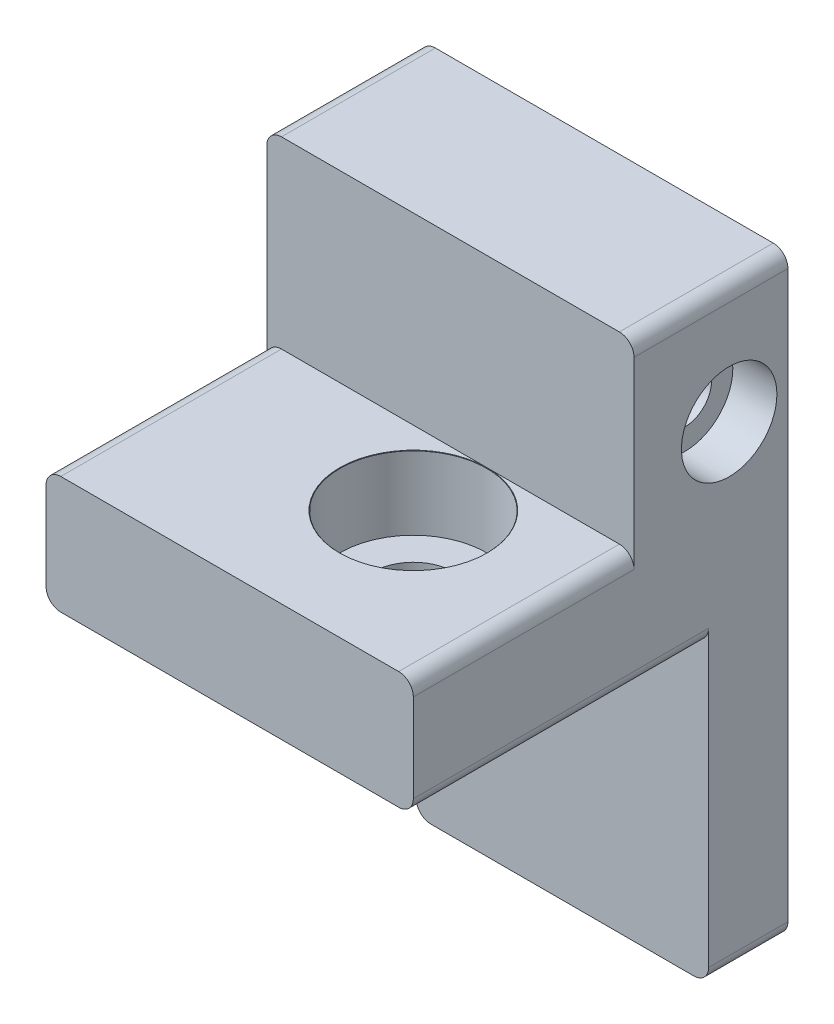
ISO-10303-21;
HEADER;
FILE_DESCRIPTION(('STEP AP214'),'2;1');
FILE_NAME('part.step','',(''),(''),'','','');
FILE_SCHEMA(('AUTOMOTIVE_DESIGN { 1 0 10303 214 1 1 1 1 }'));
ENDSEC;
DATA;
#1=APPLICATION_CONTEXT('core data for automotive mechanical design processes');
#2=APPLICATION_PROTOCOL_DEFINITION('international standard','automotive_design',2000,#1);
#3=PRODUCT_CONTEXT('',#1,'mechanical');
#4=PRODUCT('Part','Part','',(#3));
#5=PRODUCT_RELATED_PRODUCT_CATEGORY('part','',(#4));
#6=PRODUCT_DEFINITION_FORMATION('','',#4);
#7=PRODUCT_DEFINITION_CONTEXT('part definition',#1,'design');
#8=PRODUCT_DEFINITION('design','',#6,#7);
#9=PRODUCT_DEFINITION_SHAPE('','',#8);
#10=(LENGTH_UNIT() NAMED_UNIT(*) SI_UNIT(.MILLI.,.METRE.));
#11=(NAMED_UNIT(*) PLANE_ANGLE_UNIT() SI_UNIT($,.RADIAN.));
#12=(NAMED_UNIT(*) SI_UNIT($,.STERADIAN.) SOLID_ANGLE_UNIT());
#13=UNCERTAINTY_MEASURE_WITH_UNIT(LENGTH_MEASURE(1.E-05),#10,'distance_accuracy_value','');
#14=(GEOMETRIC_REPRESENTATION_CONTEXT(3) GLOBAL_UNCERTAINTY_ASSIGNED_CONTEXT((#13)) GLOBAL_UNIT_ASSIGNED_CONTEXT((#10,
#11,#12)) REPRESENTATION_CONTEXT('',''));
#15=CARTESIAN_POINT('',(0.,0.,0.));
#16=DIRECTION('',(0.,0.,1.));
#17=DIRECTION('',(1.,0.,0.));
#18=AXIS2_PLACEMENT_3D('',#15,#16,#17);
#19=CARTESIAN_POINT('',(0.,0.,0.));
#20=DIRECTION('',(0.,-1.,0.));
#21=DIRECTION('',(0.,0.,-1.));
#22=AXIS2_PLACEMENT_3D('',#19,#20,#21);
#23=PLANE('',#22);
#24=DIRECTION('',(0.,0.,-1.));
#25=VECTOR('',#24,1.);
#26=CARTESIAN_POINT('',(9.00000000000001,0.,20.));
#27=LINE('',#26,#25);
#28=CARTESIAN_POINT('',(9.00000000000001,0.,-20.1));
#29=VERTEX_POINT('',#28);
#30=CARTESIAN_POINT('',(9.00000000000001,0.,0.));
#31=VERTEX_POINT('',#30);
#32=EDGE_CURVE('E392',#29,#31,#27,.F.);
#33=ORIENTED_EDGE('',*,*,#32,.T.);
#34=DIRECTION('',(1.,0.,0.));
#35=VECTOR('',#34,1.);
#36=CARTESIAN_POINT('',(-10.,0.,0.));
#37=LINE('',#36,#35);
#38=CARTESIAN_POINT('',(-14.,0.,0.));
#39=VERTEX_POINT('',#38);
#40=EDGE_CURVE('E371',#39,#31,#37,.T.);
#41=ORIENTED_EDGE('',*,*,#40,.F.);
#42=DIRECTION('',(0.,0.,1.));
#43=VECTOR('',#42,1.);
#44=CARTESIAN_POINT('',(-14.,0.,-20.1));
#45=LINE('',#44,#43);
#46=CARTESIAN_POINT('',(-14.,0.,-20.1));
#47=VERTEX_POINT('',#46);
#48=EDGE_CURVE('E395',#39,#47,#45,.F.);
#49=ORIENTED_EDGE('',*,*,#48,.T.);
#50=DIRECTION('',(1.,0.,0.));
#51=VECTOR('',#50,1.);
#52=CARTESIAN_POINT('',(10.,0.,-20.1));
#53=LINE('',#52,#51);
#54=EDGE_CURVE('E306',#47,#29,#53,.T.);
#55=ORIENTED_EDGE('',*,*,#54,.T.);
#56=EDGE_LOOP('',(#33,#41,#49,#55));
#57=FACE_BOUND('',#56,.T.);
#58=CARTESIAN_POINT('',(0.,0.,-10.));
#59=DIRECTION('',(0.,1.,0.));
#60=DIRECTION('',(0.,0.,1.));
#61=AXIS2_PLACEMENT_3D('',#58,#59,#60);
#62=CIRCLE('',#61,2.75);
#63=CARTESIAN_POINT('',(0.,0.,-7.25));
#64=VERTEX_POINT('',#63);
#65=EDGE_CURVE('E368',#64,#64,#62,.T.);
#66=ORIENTED_EDGE('',*,*,#65,.T.);
#67=EDGE_LOOP('',(#66));
#68=FACE_BOUND('',#67,.T.);
#69=ADVANCED_FACE('F43',(#57,#68),#23,.T.);
#70=CARTESIAN_POINT('',(-15.,20.51,-18.));
#71=DIRECTION('',(0.,0.,1.));
#72=DIRECTION('',(1.,0.,0.));
#73=AXIS2_PLACEMENT_3D('',#70,#71,#72);
#74=PLANE('',#73);
#75=DIRECTION('',(0.,-1.,0.));
#76=VECTOR('',#75,1.);
#77=CARTESIAN_POINT('',(-12.,16.01,-18.));
#78=LINE('',#77,#76);
#79=CARTESIAN_POINT('',(-12.,15.71,-18.));
#80=VERTEX_POINT('',#79);
#81=CARTESIAN_POINT('',(-12.,9.05,-18.));
#82=VERTEX_POINT('',#81);
#83=EDGE_CURVE('E216',#80,#82,#78,.T.);
#84=ORIENTED_EDGE('',*,*,#83,.F.);
#85=DIRECTION('',(-1.,0.,0.));
#86=VECTOR('',#85,1.);
#87=CARTESIAN_POINT('',(-12.,15.71,-18.));
#88=LINE('',#87,#86);
#89=CARTESIAN_POINT('',(-15.,15.71,-18.));
#90=VERTEX_POINT('',#89);
#91=EDGE_CURVE('E250',#80,#90,#88,.T.);
#92=ORIENTED_EDGE('',*,*,#91,.T.);
#93=DIRECTION('',(0.,-1.,0.));
#94=VECTOR('',#93,1.);
#95=CARTESIAN_POINT('',(-15.,20.51,-18.));
#96=LINE('',#95,#94);
#97=CARTESIAN_POINT('',(-15.,17.51,-18.));
#98=VERTEX_POINT('',#97);
#99=EDGE_CURVE('E348',#98,#90,#96,.T.);
#100=ORIENTED_EDGE('',*,*,#99,.F.);
#101=DIRECTION('',(-1.,0.,0.));
#102=VECTOR('',#101,1.);
#103=CARTESIAN_POINT('',(5.,17.51,-18.));
#104=LINE('',#103,#102);
#105=CARTESIAN_POINT('',(5.,17.51,-18.));
#106=VERTEX_POINT('',#105);
#107=EDGE_CURVE('E326',#106,#98,#104,.T.);
#108=ORIENTED_EDGE('',*,*,#107,.F.);
#109=DIRECTION('',(0.,1.,0.));
#110=VECTOR('',#109,1.);
#111=CARTESIAN_POINT('',(5.,17.51,-18.));
#112=LINE('',#111,#110);
#113=CARTESIAN_POINT('',(5.00000000000001,9.05,-18.));
#114=VERTEX_POINT('',#113);
#115=EDGE_CURVE('E226',#114,#106,#112,.T.);
#116=ORIENTED_EDGE('',*,*,#115,.F.);
#117=DIRECTION('',(-1.,0.,0.));
#118=VECTOR('',#117,1.);
#119=CARTESIAN_POINT('',(5.00000000000001,9.05,-18.));
#120=LINE('',#119,#118);
#121=EDGE_CURVE('E233',#114,#82,#120,.T.);
#122=ORIENTED_EDGE('',*,*,#121,.T.);
#123=EDGE_LOOP('',(#84,#92,#100,#108,#116,#122));
#124=FACE_BOUND('',#123,.T.);
#125=ADVANCED_FACE('F239',(#124),#74,.F.);
#126=CARTESIAN_POINT('',(5.,17.51,-25.5));
#127=DIRECTION('',(1.,0.,0.));
#128=DIRECTION('',(0.,1.,0.));
#129=AXIS2_PLACEMENT_3D('',#126,#127,#128);
#130=PLANE('',#129);
#131=CARTESIAN_POINT('',(5.00000000000001,12.4800000000001,-21.5));
#132=DIRECTION('',(1.,0.,0.));
#133=DIRECTION('',(0.,1.,0.));
#134=AXIS2_PLACEMENT_3D('',#131,#132,#133);
#135=CIRCLE('',#134,1.80000000000001);
#136=CARTESIAN_POINT('',(5.,14.2800000000001,-21.5));
#137=VERTEX_POINT('',#136);
#138=EDGE_CURVE('E289',#137,#137,#135,.T.);
#139=ORIENTED_EDGE('',*,*,#138,.T.);
#140=EDGE_LOOP('',(#139));
#141=FACE_BOUND('',#140,.T.);
#142=DIRECTION('',(0.,1.,0.));
#143=VECTOR('',#142,1.);
#144=CARTESIAN_POINT('',(5.,17.51,-25.5));
#145=LINE('',#144,#143);
#146=CARTESIAN_POINT('',(5.00000000000001,9.05,-25.5));
#147=VERTEX_POINT('',#146);
#148=CARTESIAN_POINT('',(5.,17.51,-25.5));
#149=VERTEX_POINT('',#148);
#150=EDGE_CURVE('E325',#147,#149,#145,.T.);
#151=ORIENTED_EDGE('',*,*,#150,.F.);
#152=DIRECTION('',(0.,0.,-1.));
#153=VECTOR('',#152,1.);
#154=CARTESIAN_POINT('',(5.00000000000001,9.05,-0.998823570117276));
#155=LINE('',#154,#153);
#156=EDGE_CURVE('E237',#114,#147,#155,.T.);
#157=ORIENTED_EDGE('',*,*,#156,.F.);
#158=ORIENTED_EDGE('',*,*,#115,.T.);
#159=DIRECTION('',(0.,0.,1.));
#160=VECTOR('',#159,1.);
#161=CARTESIAN_POINT('',(5.,17.51,-25.5));
#162=LINE('',#161,#160);
#163=EDGE_CURVE('E341',#149,#106,#162,.T.);
#164=ORIENTED_EDGE('',*,*,#163,.F.);
#165=EDGE_LOOP('',(#151,#157,#158,#164));
#166=FACE_BOUND('',#165,.T.);
#167=ADVANCED_FACE('F518',(#141,#166),#130,.F.);
#168=CARTESIAN_POINT('',(-12.,16.01,-25.5));
#169=DIRECTION('',(-1.,0.,0.));
#170=DIRECTION('',(0.,-1.,0.));
#171=AXIS2_PLACEMENT_3D('',#168,#169,#170);
#172=PLANE('',#171);
#173=DIRECTION('',(0.,-1.,0.));
#174=VECTOR('',#173,1.);
#175=CARTESIAN_POINT('',(-12.,16.01,-25.5));
#176=LINE('',#175,#174);
#177=CARTESIAN_POINT('',(-12.,15.71,-25.5));
#178=VERTEX_POINT('',#177);
#179=CARTESIAN_POINT('',(-12.,9.05,-25.5));
#180=VERTEX_POINT('',#179);
#181=EDGE_CURVE('E317',#178,#180,#176,.T.);
#182=ORIENTED_EDGE('',*,*,#181,.F.);
#183=DIRECTION('',(0.,0.,-1.));
#184=VECTOR('',#183,1.);
#185=CARTESIAN_POINT('',(-12.,15.71,-0.998823570117276));
#186=LINE('',#185,#184);
#187=EDGE_CURVE('E222',#80,#178,#186,.T.);
#188=ORIENTED_EDGE('',*,*,#187,.F.);
#189=ORIENTED_EDGE('',*,*,#83,.T.);
#190=DIRECTION('',(0.,0.,-1.));
#191=VECTOR('',#190,1.);
#192=CARTESIAN_POINT('',(-12.,9.05,-0.998823570117276));
#193=LINE('',#192,#191);
#194=EDGE_CURVE('E220',#82,#180,#193,.T.);
#195=ORIENTED_EDGE('',*,*,#194,.T.);
#196=EDGE_LOOP('',(#182,#188,#189,#195));
#197=FACE_BOUND('',#196,.T.);
#198=ADVANCED_FACE('F219',(#197),#172,.F.);
#199=CARTESIAN_POINT('',(0.,8.,0.));
#200=DIRECTION('',(0.,-1.,0.));
#201=DIRECTION('',(0.,0.,-1.));
#202=AXIS2_PLACEMENT_3D('',#199,#200,#201);
#203=PLANE('',#202);
#204=DIRECTION('',(1.,0.,0.));
#205=VECTOR('',#204,1.);
#206=CARTESIAN_POINT('',(-10.,8.,0.));
#207=LINE('',#206,#205);
#208=CARTESIAN_POINT('',(-14.,8.,0.));
#209=VERTEX_POINT('',#208);
#210=CARTESIAN_POINT('',(9.00000000000001,8.,0.));
#211=VERTEX_POINT('',#210);
#212=EDGE_CURVE('E372',#209,#211,#207,.T.);
#213=ORIENTED_EDGE('',*,*,#212,.T.);
#214=DIRECTION('',(0.,0.,-1.));
#215=VECTOR('',#214,1.);
#216=CARTESIAN_POINT('',(9.00000000000001,8.,0.));
#217=LINE('',#216,#215);
#218=CARTESIAN_POINT('',(9.00000000000001,8.,-15.025));
#219=VERTEX_POINT('',#218);
#220=EDGE_CURVE('E407',#211,#219,#217,.T.);
#221=ORIENTED_EDGE('',*,*,#220,.T.);
#222=DIRECTION('',(1.,0.,0.));
#223=VECTOR('',#222,1.);
#224=CARTESIAN_POINT('',(-15.,8.,-15.025));
#225=LINE('',#224,#223);
#226=CARTESIAN_POINT('',(0.,8.,-15.025));
#227=VERTEX_POINT('',#226);
#228=EDGE_CURVE('E350',#227,#219,#225,.T.);
#229=ORIENTED_EDGE('',*,*,#228,.F.);
#230=CARTESIAN_POINT('',(0.,8.,-10.));
#231=DIRECTION('',(0.,1.,0.));
#232=DIRECTION('',(0.,0.,1.));
#233=AXIS2_PLACEMENT_3D('',#230,#231,#232);
#234=CIRCLE('',#233,5.025);
#235=EDGE_CURVE('E356',#227,#227,#234,.T.);
#236=ORIENTED_EDGE('',*,*,#235,.F.);
#237=CARTESIAN_POINT('',(-14.,8.,-15.025));
#238=VERTEX_POINT('',#237);
#239=EDGE_CURVE('E344',#238,#227,#225,.T.);
#240=ORIENTED_EDGE('',*,*,#239,.F.);
#241=DIRECTION('',(0.,0.,1.));
#242=VECTOR('',#241,1.);
#243=CARTESIAN_POINT('',(-14.,8.,0.));
#244=LINE('',#243,#242);
#245=EDGE_CURVE('E409',#238,#209,#244,.T.);
#246=ORIENTED_EDGE('',*,*,#245,.T.);
#247=EDGE_LOOP('',(#213,#221,#229,#236,#240,#246));
#248=FACE_BOUND('',#247,.T.);
#249=ADVANCED_FACE('F495',(#248),#203,.F.);
#250=CARTESIAN_POINT('',(10.,8.,20.));
#251=DIRECTION('',(-1.,0.,0.));
#252=DIRECTION('',(0.,0.,1.));
#253=AXIS2_PLACEMENT_3D('',#250,#251,#252);
#254=PLANE('',#253);
#255=CARTESIAN_POINT('',(10.,12.4800000000001,-21.5));
#256=DIRECTION('',(1.,0.,0.));
#257=DIRECTION('',(0.,0.,-1.));
#258=AXIS2_PLACEMENT_3D('',#255,#256,#257);
#259=CIRCLE('',#258,3.25);
#260=CARTESIAN_POINT('',(10.,12.4800000000001,-24.75));
#261=VERTEX_POINT('',#260);
#262=EDGE_CURVE('E272',#261,#261,#259,.T.);
#263=ORIENTED_EDGE('',*,*,#262,.F.);
#264=EDGE_LOOP('',(#263));
#265=FACE_BOUND('',#264,.T.);
#266=DIRECTION('',(0.,0.,-1.));
#267=VECTOR('',#266,1.);
#268=CARTESIAN_POINT('',(10.,7.,20.));
#269=LINE('',#268,#267);
#270=CARTESIAN_POINT('',(10.,7.,-15.025));
#271=VERTEX_POINT('',#270);
#272=CARTESIAN_POINT('',(10.,7.,0.));
#273=VERTEX_POINT('',#272);
#274=EDGE_CURVE('E402',#271,#273,#269,.F.);
#275=ORIENTED_EDGE('',*,*,#274,.T.);
#276=DIRECTION('',(0.,1.,0.));
#277=VECTOR('',#276,1.);
#278=CARTESIAN_POINT('',(10.,-20.,0.));
#279=LINE('',#278,#277);
#280=CARTESIAN_POINT('',(10.,1.,0.));
#281=VERTEX_POINT('',#280);
#282=EDGE_CURVE('E57',#281,#273,#279,.T.);
#283=ORIENTED_EDGE('',*,*,#282,.F.);
#284=DIRECTION('',(0.,0.,-1.));
#285=VECTOR('',#284,1.);
#286=CARTESIAN_POINT('',(10.,1.,-20.1));
#287=LINE('',#286,#285);
#288=CARTESIAN_POINT('',(10.,1.,-20.1));
#289=VERTEX_POINT('',#288);
#290=EDGE_CURVE('E405',#281,#289,#287,.T.);
#291=ORIENTED_EDGE('',*,*,#290,.T.);
#292=DIRECTION('',(0.,-1.,0.));
#293=VECTOR('',#292,1.);
#294=CARTESIAN_POINT('',(10.,-20.,-20.1));
#295=LINE('',#294,#293);
#296=CARTESIAN_POINT('',(10.,-19.,-20.1));
#297=VERTEX_POINT('',#296);
#298=EDGE_CURVE('E293',#289,#297,#295,.T.);
#299=ORIENTED_EDGE('',*,*,#298,.T.);
#300=DIRECTION('',(0.,0.,-1.));
#301=VECTOR('',#300,1.);
#302=CARTESIAN_POINT('',(10.,-19.,-25.5));
#303=LINE('',#302,#301);
#304=CARTESIAN_POINT('',(10.,-19.,-25.5));
#305=VERTEX_POINT('',#304);
#306=EDGE_CURVE('E397',#297,#305,#303,.T.);
#307=ORIENTED_EDGE('',*,*,#306,.T.);
#308=DIRECTION('',(0.,-1.,0.));
#309=VECTOR('',#308,1.);
#310=CARTESIAN_POINT('',(10.,20.51,-25.5));
#311=LINE('',#310,#309);
#312=CARTESIAN_POINT('',(10.,19.51,-25.5));
#313=VERTEX_POINT('',#312);
#314=EDGE_CURVE('E322',#313,#305,#311,.T.);
#315=ORIENTED_EDGE('',*,*,#314,.F.);
#316=DIRECTION('',(0.,0.,-1.));
#317=VECTOR('',#316,1.);
#318=CARTESIAN_POINT('',(10.,19.51,-15.025));
#319=LINE('',#318,#317);
#320=CARTESIAN_POINT('',(10.,19.51,-15.025));
#321=VERTEX_POINT('',#320);
#322=EDGE_CURVE('E400',#313,#321,#319,.F.);
#323=ORIENTED_EDGE('',*,*,#322,.T.);
#324=DIRECTION('',(0.,-1.,0.));
#325=VECTOR('',#324,1.);
#326=CARTESIAN_POINT('',(10.,20.51,-15.025));
#327=LINE('',#326,#325);
#328=EDGE_CURVE('E352',#321,#271,#327,.T.);
#329=ORIENTED_EDGE('',*,*,#328,.T.);
#330=EDGE_LOOP('',(#275,#283,#291,#299,#307,#315,#323,#329));
#331=FACE_BOUND('',#330,.T.);
#332=ADVANCED_FACE('F467',(#265,#331),#254,.F.);
#333=CARTESIAN_POINT('',(-15.,8.,0.));
#334=DIRECTION('',(1.,0.,0.));
#335=DIRECTION('',(0.,0.,-1.));
#336=AXIS2_PLACEMENT_3D('',#333,#334,#335);
#337=PLANE('',#336);
#338=ORIENTED_EDGE('',*,*,#99,.T.);
#339=DIRECTION('',(0.,0.,-1.));
#340=VECTOR('',#339,1.);
#341=CARTESIAN_POINT('',(-15.,15.71,-0.998823570117276));
#342=LINE('',#341,#340);
#343=CARTESIAN_POINT('',(-15.,15.71,-25.5));
#344=VERTEX_POINT('',#343);
#345=EDGE_CURVE('E247',#90,#344,#342,.T.);
#346=ORIENTED_EDGE('',*,*,#345,.T.);
#347=DIRECTION('',(0.,1.,0.));
#348=VECTOR('',#347,1.);
#349=CARTESIAN_POINT('',(-15.,8.,-25.5));
#350=LINE('',#349,#348);
#351=CARTESIAN_POINT('',(-15.,-4.4,-25.5));
#352=VERTEX_POINT('',#351);
#353=EDGE_CURVE('E227',#352,#344,#350,.T.);
#354=ORIENTED_EDGE('',*,*,#353,.F.);
#355=DIRECTION('',(0.,0.,-1.));
#356=VECTOR('',#355,1.);
#357=CARTESIAN_POINT('',(-15.,-4.4,-20.1));
#358=LINE('',#357,#356);
#359=CARTESIAN_POINT('',(-15.,-4.4,-20.1));
#360=VERTEX_POINT('',#359);
#361=EDGE_CURVE('E378',#352,#360,#358,.F.);
#362=ORIENTED_EDGE('',*,*,#361,.T.);
#363=DIRECTION('',(0.,1.,0.));
#364=VECTOR('',#363,1.);
#365=CARTESIAN_POINT('',(-15.,0.,-20.1));
#366=LINE('',#365,#364);
#367=CARTESIAN_POINT('',(-15.,1.,-20.1));
#368=VERTEX_POINT('',#367);
#369=EDGE_CURVE('E304',#360,#368,#366,.T.);
#370=ORIENTED_EDGE('',*,*,#369,.T.);
#371=DIRECTION('',(0.,0.,1.));
#372=VECTOR('',#371,1.);
#373=CARTESIAN_POINT('',(-15.,1.,0.));
#374=LINE('',#373,#372);
#375=CARTESIAN_POINT('',(-15.,1.,0.));
#376=VERTEX_POINT('',#375);
#377=EDGE_CURVE('E385',#368,#376,#374,.T.);
#378=ORIENTED_EDGE('',*,*,#377,.T.);
#379=DIRECTION('',(0.,-1.,0.));
#380=VECTOR('',#379,1.);
#381=CARTESIAN_POINT('',(-15.,8.,0.));
#382=LINE('',#381,#380);
#383=CARTESIAN_POINT('',(-15.,7.,0.));
#384=VERTEX_POINT('',#383);
#385=EDGE_CURVE('E374',#384,#376,#382,.T.);
#386=ORIENTED_EDGE('',*,*,#385,.F.);
#387=DIRECTION('',(0.,0.,1.));
#388=VECTOR('',#387,1.);
#389=CARTESIAN_POINT('',(-15.,7.,0.));
#390=LINE('',#389,#388);
#391=CARTESIAN_POINT('',(-15.,7.,-15.025));
#392=VERTEX_POINT('',#391);
#393=EDGE_CURVE('E382',#384,#392,#390,.F.);
#394=ORIENTED_EDGE('',*,*,#393,.T.);
#395=DIRECTION('',(0.,-1.,0.));
#396=VECTOR('',#395,1.);
#397=CARTESIAN_POINT('',(-15.,20.51,-15.025));
#398=LINE('',#397,#396);
#399=CARTESIAN_POINT('',(-15.,19.51,-15.025));
#400=VERTEX_POINT('',#399);
#401=EDGE_CURVE('E354',#400,#392,#398,.T.);
#402=ORIENTED_EDGE('',*,*,#401,.F.);
#403=DIRECTION('',(0.,0.,1.));
#404=VECTOR('',#403,1.);
#405=CARTESIAN_POINT('',(-15.,19.51,-25.5));
#406=LINE('',#405,#404);
#407=CARTESIAN_POINT('',(-15.,19.51,-25.5));
#408=VERTEX_POINT('',#407);
#409=EDGE_CURVE('E380',#400,#408,#406,.F.);
#410=ORIENTED_EDGE('',*,*,#409,.T.);
#411=DIRECTION('',(0.,1.,0.));
#412=VECTOR('',#411,1.);
#413=CARTESIAN_POINT('',(-15.,20.51,-25.5));
#414=LINE('',#413,#412);
#415=CARTESIAN_POINT('',(-15.,17.51,-25.5));
#416=VERTEX_POINT('',#415);
#417=EDGE_CURVE('E330',#416,#408,#414,.T.);
#418=ORIENTED_EDGE('',*,*,#417,.F.);
#419=DIRECTION('',(0.,0.,1.));
#420=VECTOR('',#419,1.);
#421=CARTESIAN_POINT('',(-15.,17.51,-25.5));
#422=LINE('',#421,#420);
#423=EDGE_CURVE('E336',#416,#98,#422,.T.);
#424=ORIENTED_EDGE('',*,*,#423,.T.);
#425=EDGE_LOOP('',(#338,#346,#354,#362,#370,#378,#386,#394,#402,#410,#418,#424));
#426=FACE_BOUND('',#425,.T.);
#427=ADVANCED_FACE('F484',(#426),#337,.F.);
#428=CARTESIAN_POINT('',(-10.,8.,0.));
#429=DIRECTION('',(0.,0.,-1.));
#430=DIRECTION('',(-1.,0.,0.));
#431=AXIS2_PLACEMENT_3D('',#428,#429,#430);
#432=PLANE('',#431);
#433=CARTESIAN_POINT('',(9.00000000000001,7.,0.));
#434=DIRECTION('',(0.,0.,-1.));
#435=DIRECTION('',(-1.,0.,0.));
#436=AXIS2_PLACEMENT_3D('',#433,#434,#435);
#437=CIRCLE('',#436,1.);
#438=EDGE_CURVE('E11',#273,#211,#437,.F.);
#439=ORIENTED_EDGE('',*,*,#438,.T.);
#440=ORIENTED_EDGE('',*,*,#212,.F.);
#441=CARTESIAN_POINT('',(-14.,7.,0.));
#442=DIRECTION('',(0.,0.,-1.));
#443=DIRECTION('',(-1.,0.,0.));
#444=AXIS2_PLACEMENT_3D('',#441,#442,#443);
#445=CIRCLE('',#444,1.);
#446=EDGE_CURVE('E388',#209,#384,#445,.F.);
#447=ORIENTED_EDGE('',*,*,#446,.T.);
#448=ORIENTED_EDGE('',*,*,#385,.T.);
#449=CARTESIAN_POINT('',(-14.,1.,0.));
#450=DIRECTION('',(0.,0.,-1.));
#451=DIRECTION('',(-1.,0.,0.));
#452=AXIS2_PLACEMENT_3D('',#449,#450,#451);
#453=CIRCLE('',#452,1.);
#454=EDGE_CURVE('E390',#376,#39,#453,.F.);
#455=ORIENTED_EDGE('',*,*,#454,.T.);
#456=ORIENTED_EDGE('',*,*,#40,.T.);
#457=CARTESIAN_POINT('',(9.00000000000001,1.,0.));
#458=DIRECTION('',(0.,0.,-1.));
#459=DIRECTION('',(-1.,0.,0.));
#460=AXIS2_PLACEMENT_3D('',#457,#458,#459);
#461=CIRCLE('',#460,1.);
#462=EDGE_CURVE('E254',#31,#281,#461,.F.);
#463=ORIENTED_EDGE('',*,*,#462,.T.);
#464=ORIENTED_EDGE('',*,*,#282,.T.);
#465=EDGE_LOOP('',(#439,#440,#447,#448,#455,#456,#463,#464));
#466=FACE_BOUND('',#465,.T.);
#467=ADVANCED_FACE('F524',(#466),#432,.F.);
#468=CARTESIAN_POINT('',(0.,8.,-10.));
#469=DIRECTION('',(0.,1.,0.));
#470=DIRECTION('',(0.,0.,1.));
#471=AXIS2_PLACEMENT_3D('',#468,#469,#470);
#472=CYLINDRICAL_SURFACE('',#471,2.75);
#473=ORIENTED_EDGE('',*,*,#65,.F.);
#474=EDGE_LOOP('',(#473));
#475=FACE_BOUND('',#474,.T.);
#476=CARTESIAN_POINT('',(0.,3.,-10.));
#477=DIRECTION('',(0.,1.,0.));
#478=DIRECTION('',(0.,0.,1.));
#479=AXIS2_PLACEMENT_3D('',#476,#477,#478);
#480=CIRCLE('',#479,2.75);
#481=CARTESIAN_POINT('',(0.,3.,-7.25));
#482=VERTEX_POINT('',#481);
#483=EDGE_CURVE('E365',#482,#482,#480,.T.);
#484=ORIENTED_EDGE('',*,*,#483,.T.);
#485=EDGE_LOOP('',(#484));
#486=FACE_BOUND('',#485,.T.);
#487=ADVANCED_FACE('F527',(#475,#486),#472,.F.);
#488=CARTESIAN_POINT('',(5.,3.,-10.));
#489=DIRECTION('',(0.,-1.,0.));
#490=DIRECTION('',(0.,0.,-1.));
#491=AXIS2_PLACEMENT_3D('',#488,#489,#490);
#492=PLANE('',#491);
#493=ORIENTED_EDGE('',*,*,#483,.F.);
#494=EDGE_LOOP('',(#493));
#495=FACE_BOUND('',#494,.T.);
#496=CARTESIAN_POINT('',(0.,3.,-10.));
#497=DIRECTION('',(0.,1.,0.));
#498=DIRECTION('',(0.,0.,1.));
#499=AXIS2_PLACEMENT_3D('',#496,#497,#498);
#500=CIRCLE('',#499,5.);
#501=CARTESIAN_POINT('',(0.,3.,-5.));
#502=VERTEX_POINT('',#501);
#503=EDGE_CURVE('E362',#502,#502,#500,.T.);
#504=ORIENTED_EDGE('',*,*,#503,.T.);
#505=EDGE_LOOP('',(#504));
#506=FACE_BOUND('',#505,.T.);
#507=ADVANCED_FACE('F508',(#495,#506),#492,.F.);
#508=CARTESIAN_POINT('',(0.,8.,-10.));
#509=DIRECTION('',(0.,1.,0.));
#510=DIRECTION('',(0.,0.,1.));
#511=AXIS2_PLACEMENT_3D('',#508,#509,#510);
#512=CYLINDRICAL_SURFACE('',#511,5.);
#513=ORIENTED_EDGE('',*,*,#503,.F.);
#514=EDGE_LOOP('',(#513));
#515=FACE_BOUND('',#514,.T.);
#516=CARTESIAN_POINT('',(0.,7.975,-10.));
#517=DIRECTION('',(0.,1.,0.));
#518=DIRECTION('',(0.,0.,1.));
#519=AXIS2_PLACEMENT_3D('',#516,#517,#518);
#520=CIRCLE('',#519,5.);
#521=CARTESIAN_POINT('',(0.,7.975,-5.));
#522=VERTEX_POINT('',#521);
#523=EDGE_CURVE('E359',#522,#522,#520,.T.);
#524=ORIENTED_EDGE('',*,*,#523,.T.);
#525=EDGE_LOOP('',(#524));
#526=FACE_BOUND('',#525,.T.);
#527=ADVANCED_FACE('F500',(#515,#526),#512,.F.);
#528=CARTESIAN_POINT('',(0.,8.,-10.));
#529=DIRECTION('',(0.,1.,0.));
#530=DIRECTION('',(0.,0.,1.));
#531=AXIS2_PLACEMENT_3D('',#528,#529,#530);
#532=CONICAL_SURFACE('',#531,5.025,0.785398163397466);
#533=ORIENTED_EDGE('',*,*,#523,.F.);
#534=EDGE_LOOP('',(#533));
#535=FACE_BOUND('',#534,.T.);
#536=ORIENTED_EDGE('',*,*,#235,.T.);
#537=EDGE_LOOP('',(#536));
#538=FACE_BOUND('',#537,.T.);
#539=ADVANCED_FACE('F498',(#535,#538),#532,.F.);
#540=CARTESIAN_POINT('',(-15.,20.51,-15.025));
#541=DIRECTION('',(0.,0.,-1.));
#542=DIRECTION('',(-1.,0.,0.));
#543=AXIS2_PLACEMENT_3D('',#540,#541,#542);
#544=PLANE('',#543);
#545=DIRECTION('',(1.,0.,0.));
#546=VECTOR('',#545,1.);
#547=CARTESIAN_POINT('',(-15.,20.51,-15.025));
#548=LINE('',#547,#546);
#549=CARTESIAN_POINT('',(-14.,20.51,-15.025));
#550=VERTEX_POINT('',#549);
#551=CARTESIAN_POINT('',(9.00000000000001,20.51,-15.025));
#552=VERTEX_POINT('',#551);
#553=EDGE_CURVE('E345',#550,#552,#548,.T.);
#554=ORIENTED_EDGE('',*,*,#553,.F.);
#555=CARTESIAN_POINT('',(-14.,19.51,-15.025));
#556=DIRECTION('',(0.,0.,-1.));
#557=DIRECTION('',(-1.,0.,0.));
#558=AXIS2_PLACEMENT_3D('',#555,#556,#557);
#559=CIRCLE('',#558,1.);
#560=EDGE_CURVE('E420',#550,#400,#559,.F.);
#561=ORIENTED_EDGE('',*,*,#560,.T.);
#562=ORIENTED_EDGE('',*,*,#401,.T.);
#563=CARTESIAN_POINT('',(-14.,7.,-15.025));
#564=DIRECTION('',(0.,0.,-1.));
#565=DIRECTION('',(-1.,0.,0.));
#566=AXIS2_PLACEMENT_3D('',#563,#564,#565);
#567=CIRCLE('',#566,1.);
#568=EDGE_CURVE('E452',#392,#238,#567,.T.);
#569=ORIENTED_EDGE('',*,*,#568,.T.);
#570=ORIENTED_EDGE('',*,*,#239,.T.);
#571=ORIENTED_EDGE('',*,*,#228,.T.);
#572=CARTESIAN_POINT('',(9.00000000000001,7.,-15.025));
#573=DIRECTION('',(0.,0.,-1.));
#574=DIRECTION('',(-1.,0.,0.));
#575=AXIS2_PLACEMENT_3D('',#572,#573,#574);
#576=CIRCLE('',#575,1.);
#577=EDGE_CURVE('E51',#219,#271,#576,.T.);
#578=ORIENTED_EDGE('',*,*,#577,.T.);
#579=ORIENTED_EDGE('',*,*,#328,.F.);
#580=CARTESIAN_POINT('',(9.00000000000001,19.51,-15.025));
#581=DIRECTION('',(0.,0.,-1.));
#582=DIRECTION('',(-1.,0.,0.));
#583=AXIS2_PLACEMENT_3D('',#580,#581,#582);
#584=CIRCLE('',#583,1.);
#585=EDGE_CURVE('E418',#321,#552,#584,.F.);
#586=ORIENTED_EDGE('',*,*,#585,.T.);
#587=EDGE_LOOP('',(#554,#561,#562,#569,#570,#571,#578,#579,#586));
#588=FACE_BOUND('',#587,.T.);
#589=ADVANCED_FACE('F460',(#588),#544,.F.);
#590=CARTESIAN_POINT('',(0.,20.51,0.));
#591=DIRECTION('',(0.,1.,0.));
#592=DIRECTION('',(0.,0.,1.));
#593=AXIS2_PLACEMENT_3D('',#590,#591,#592);
#594=PLANE('',#593);
#595=DIRECTION('',(1.,0.,0.));
#596=VECTOR('',#595,1.);
#597=CARTESIAN_POINT('',(10.,20.51,-25.5));
#598=LINE('',#597,#596);
#599=CARTESIAN_POINT('',(-14.,20.51,-25.5));
#600=VERTEX_POINT('',#599);
#601=CARTESIAN_POINT('',(9.00000000000001,20.51,-25.5));
#602=VERTEX_POINT('',#601);
#603=EDGE_CURVE('E333',#600,#602,#598,.T.);
#604=ORIENTED_EDGE('',*,*,#603,.F.);
#605=DIRECTION('',(0.,0.,1.));
#606=VECTOR('',#605,1.);
#607=CARTESIAN_POINT('',(-14.,20.51,-15.025));
#608=LINE('',#607,#606);
#609=EDGE_CURVE('E415',#600,#550,#608,.T.);
#610=ORIENTED_EDGE('',*,*,#609,.T.);
#611=ORIENTED_EDGE('',*,*,#553,.T.);
#612=DIRECTION('',(0.,0.,-1.));
#613=VECTOR('',#612,1.);
#614=CARTESIAN_POINT('',(9.00000000000001,20.51,-25.5));
#615=LINE('',#614,#613);
#616=EDGE_CURVE('E412',#552,#602,#615,.T.);
#617=ORIENTED_EDGE('',*,*,#616,.T.);
#618=EDGE_LOOP('',(#604,#610,#611,#617));
#619=FACE_BOUND('',#618,.T.);
#620=ADVANCED_FACE('F476',(#619),#594,.T.);
#621=CARTESIAN_POINT('',(5.,17.51,-25.5));
#622=DIRECTION('',(0.,1.,0.));
#623=DIRECTION('',(0.,0.,1.));
#624=AXIS2_PLACEMENT_3D('',#621,#622,#623);
#625=PLANE('',#624);
#626=ORIENTED_EDGE('',*,*,#107,.T.);
#627=ORIENTED_EDGE('',*,*,#423,.F.);
#628=DIRECTION('',(-1.,0.,0.));
#629=VECTOR('',#628,1.);
#630=CARTESIAN_POINT('',(5.,17.51,-25.5));
#631=LINE('',#630,#629);
#632=EDGE_CURVE('E328',#149,#416,#631,.T.);
#633=ORIENTED_EDGE('',*,*,#632,.F.);
#634=ORIENTED_EDGE('',*,*,#163,.T.);
#635=EDGE_LOOP('',(#626,#627,#633,#634));
#636=FACE_BOUND('',#635,.T.);
#637=ADVANCED_FACE('F607',(#636),#625,.F.);
#638=CARTESIAN_POINT('',(0.,0.,-25.5));
#639=DIRECTION('',(0.,0.,1.));
#640=DIRECTION('',(1.,0.,0.));
#641=AXIS2_PLACEMENT_3D('',#638,#639,#640);
#642=PLANE('',#641);
#643=CARTESIAN_POINT('',(-10.,4.,-25.5));
#644=DIRECTION('',(0.,0.,-1.));
#645=DIRECTION('',(-1.,0.,0.));
#646=AXIS2_PLACEMENT_3D('',#643,#644,#645);
#647=CIRCLE('',#646,2.4);
#648=CARTESIAN_POINT('',(-12.4,4.,-25.5));
#649=VERTEX_POINT('',#648);
#650=EDGE_CURVE('E273',#649,#649,#647,.T.);
#651=ORIENTED_EDGE('',*,*,#650,.F.);
#652=EDGE_LOOP('',(#651));
#653=FACE_BOUND('',#652,.T.);
#654=CARTESIAN_POINT('',(5.,4.,-25.5));
#655=DIRECTION('',(0.,0.,-1.));
#656=DIRECTION('',(-1.,0.,0.));
#657=AXIS2_PLACEMENT_3D('',#654,#655,#656);
#658=CIRCLE('',#657,2.4);
#659=CARTESIAN_POINT('',(2.6,4.,-25.5));
#660=VERTEX_POINT('',#659);
#661=EDGE_CURVE('E276',#660,#660,#658,.T.);
#662=ORIENTED_EDGE('',*,*,#661,.F.);
#663=EDGE_LOOP('',(#662));
#664=FACE_BOUND('',#663,.T.);
#665=ORIENTED_EDGE('',*,*,#181,.T.);
#666=DIRECTION('',(-1.,0.,0.));
#667=VECTOR('',#666,1.);
#668=CARTESIAN_POINT('',(5.00000000000001,9.05,-25.5));
#669=LINE('',#668,#667);
#670=EDGE_CURVE('E236',#147,#180,#669,.T.);
#671=ORIENTED_EDGE('',*,*,#670,.F.);
#672=ORIENTED_EDGE('',*,*,#150,.T.);
#673=ORIENTED_EDGE('',*,*,#632,.T.);
#674=ORIENTED_EDGE('',*,*,#417,.T.);
#675=CARTESIAN_POINT('',(-14.,19.51,-25.5));
#676=DIRECTION('',(0.,0.,1.));
#677=DIRECTION('',(1.,0.,0.));
#678=AXIS2_PLACEMENT_3D('',#675,#676,#677);
#679=CIRCLE('',#678,1.);
#680=EDGE_CURVE('E430',#408,#600,#679,.F.);
#681=ORIENTED_EDGE('',*,*,#680,.T.);
#682=ORIENTED_EDGE('',*,*,#603,.T.);
#683=CARTESIAN_POINT('',(9.00000000000001,19.51,-25.5));
#684=DIRECTION('',(0.,0.,1.));
#685=DIRECTION('',(1.,0.,0.));
#686=AXIS2_PLACEMENT_3D('',#683,#684,#685);
#687=CIRCLE('',#686,1.);
#688=EDGE_CURVE('E428',#602,#313,#687,.F.);
#689=ORIENTED_EDGE('',*,*,#688,.T.);
#690=ORIENTED_EDGE('',*,*,#314,.T.);
#691=CARTESIAN_POINT('',(9.00000000000001,-19.,-25.5));
#692=DIRECTION('',(0.,0.,1.));
#693=DIRECTION('',(1.,0.,0.));
#694=AXIS2_PLACEMENT_3D('',#691,#692,#693);
#695=CIRCLE('',#694,1.);
#696=CARTESIAN_POINT('',(9.00000000000001,-20.,-25.5));
#697=VERTEX_POINT('',#696);
#698=EDGE_CURVE('E422',#305,#697,#695,.F.);
#699=ORIENTED_EDGE('',*,*,#698,.T.);
#700=DIRECTION('',(-1.,0.,0.));
#701=VECTOR('',#700,1.);
#702=CARTESIAN_POINT('',(-9.9,-20.,-25.5));
#703=LINE('',#702,#701);
#704=CARTESIAN_POINT('',(-8.9,-20.,-25.5));
#705=VERTEX_POINT('',#704);
#706=EDGE_CURVE('E292',#697,#705,#703,.T.);
#707=ORIENTED_EDGE('',*,*,#706,.T.);
#708=CARTESIAN_POINT('',(-8.9,-19.,-25.5));
#709=DIRECTION('',(0.,0.,1.));
#710=DIRECTION('',(1.,0.,0.));
#711=AXIS2_PLACEMENT_3D('',#708,#709,#710);
#712=CIRCLE('',#711,1.);
#713=CARTESIAN_POINT('',(-9.9,-19.,-25.5));
#714=VERTEX_POINT('',#713);
#715=EDGE_CURVE('E424',#705,#714,#712,.F.);
#716=ORIENTED_EDGE('',*,*,#715,.T.);
#717=DIRECTION('',(0.,1.,0.));
#718=VECTOR('',#717,1.);
#719=CARTESIAN_POINT('',(-9.9,-5.4,-25.5));
#720=LINE('',#719,#718);
#721=CARTESIAN_POINT('',(-9.9,-5.4,-25.5));
#722=VERTEX_POINT('',#721);
#723=EDGE_CURVE('E312',#714,#722,#720,.T.);
#724=ORIENTED_EDGE('',*,*,#723,.T.);
#725=DIRECTION('',(-1.,0.,0.));
#726=VECTOR('',#725,1.);
#727=CARTESIAN_POINT('',(-15.,-5.4,-25.5));
#728=LINE('',#727,#726);
#729=CARTESIAN_POINT('',(-14.,-5.4,-25.5));
#730=VERTEX_POINT('',#729);
#731=EDGE_CURVE('E297',#722,#730,#728,.T.);
#732=ORIENTED_EDGE('',*,*,#731,.T.);
#733=CARTESIAN_POINT('',(-14.,-4.4,-25.5));
#734=DIRECTION('',(0.,0.,1.));
#735=DIRECTION('',(1.,0.,0.));
#736=AXIS2_PLACEMENT_3D('',#733,#734,#735);
#737=CIRCLE('',#736,1.);
#738=EDGE_CURVE('E426',#730,#352,#737,.F.);
#739=ORIENTED_EDGE('',*,*,#738,.T.);
#740=ORIENTED_EDGE('',*,*,#353,.T.);
#741=DIRECTION('',(-1.,0.,0.));
#742=VECTOR('',#741,1.);
#743=CARTESIAN_POINT('',(-12.,15.71,-25.5));
#744=LINE('',#743,#742);
#745=EDGE_CURVE('E242',#178,#344,#744,.T.);
#746=ORIENTED_EDGE('',*,*,#745,.F.);
#747=EDGE_LOOP('',(#665,#671,#672,#673,#674,#681,#682,#689,#690,#699,#707,#716,#724,#732,#739,
#740,#746));
#748=FACE_BOUND('',#747,.T.);
#749=ADVANCED_FACE('F568',(#653,#664,#748),#642,.F.);
#750=CARTESIAN_POINT('',(-15.,-5.4,-20.1));
#751=DIRECTION('',(0.,-1.,0.));
#752=DIRECTION('',(1.,0.,0.));
#753=AXIS2_PLACEMENT_3D('',#750,#751,#752);
#754=PLANE('',#753);
#755=DIRECTION('',(-1.,0.,0.));
#756=VECTOR('',#755,1.);
#757=CARTESIAN_POINT('',(-15.,-5.4,-20.1));
#758=LINE('',#757,#756);
#759=CARTESIAN_POINT('',(-9.9,-5.4,-20.1));
#760=VERTEX_POINT('',#759);
#761=CARTESIAN_POINT('',(-14.,-5.4,-20.1));
#762=VERTEX_POINT('',#761);
#763=EDGE_CURVE('E301',#760,#762,#758,.T.);
#764=ORIENTED_EDGE('',*,*,#763,.T.);
#765=DIRECTION('',(0.,0.,-1.));
#766=VECTOR('',#765,1.);
#767=CARTESIAN_POINT('',(-14.,-5.4,-25.5));
#768=LINE('',#767,#766);
#769=EDGE_CURVE('E432',#762,#730,#768,.T.);
#770=ORIENTED_EDGE('',*,*,#769,.T.);
#771=ORIENTED_EDGE('',*,*,#731,.F.);
#772=DIRECTION('',(0.,0.,-1.));
#773=VECTOR('',#772,1.);
#774=CARTESIAN_POINT('',(-9.9,-5.4,-20.1));
#775=LINE('',#774,#773);
#776=EDGE_CURVE('E309',#760,#722,#775,.T.);
#777=ORIENTED_EDGE('',*,*,#776,.F.);
#778=EDGE_LOOP('',(#764,#770,#771,#777));
#779=FACE_BOUND('',#778,.T.);
#780=ADVANCED_FACE('F589',(#779),#754,.T.);
#781=CARTESIAN_POINT('',(-9.9,-5.4,-20.1));
#782=DIRECTION('',(-1.,0.,0.));
#783=DIRECTION('',(0.,0.,1.));
#784=AXIS2_PLACEMENT_3D('',#781,#782,#783);
#785=PLANE('',#784);
#786=ORIENTED_EDGE('',*,*,#723,.F.);
#787=DIRECTION('',(0.,0.,-1.));
#788=VECTOR('',#787,1.);
#789=CARTESIAN_POINT('',(-9.9,-19.,-20.1));
#790=LINE('',#789,#788);
#791=CARTESIAN_POINT('',(-9.9,-19.,-20.1));
#792=VERTEX_POINT('',#791);
#793=EDGE_CURVE('E445',#714,#792,#790,.F.);
#794=ORIENTED_EDGE('',*,*,#793,.T.);
#795=DIRECTION('',(0.,1.,0.));
#796=VECTOR('',#795,1.);
#797=CARTESIAN_POINT('',(-9.9,-5.4,-20.1));
#798=LINE('',#797,#796);
#799=EDGE_CURVE('E299',#792,#760,#798,.T.);
#800=ORIENTED_EDGE('',*,*,#799,.T.);
#801=ORIENTED_EDGE('',*,*,#776,.T.);
#802=EDGE_LOOP('',(#786,#794,#800,#801));
#803=FACE_BOUND('',#802,.T.);
#804=ADVANCED_FACE('F592',(#803),#785,.T.);
#805=CARTESIAN_POINT('',(-9.9,-20.,-20.1));
#806=DIRECTION('',(0.,-1.,0.));
#807=DIRECTION('',(1.,0.,0.));
#808=AXIS2_PLACEMENT_3D('',#805,#806,#807);
#809=PLANE('',#808);
#810=DIRECTION('',(-1.,0.,0.));
#811=VECTOR('',#810,1.);
#812=CARTESIAN_POINT('',(-9.9,-20.,-20.1));
#813=LINE('',#812,#811);
#814=CARTESIAN_POINT('',(9.00000000000001,-20.,-20.1));
#815=VERTEX_POINT('',#814);
#816=CARTESIAN_POINT('',(-8.9,-20.,-20.1));
#817=VERTEX_POINT('',#816);
#818=EDGE_CURVE('E296',#815,#817,#813,.T.);
#819=ORIENTED_EDGE('',*,*,#818,.T.);
#820=DIRECTION('',(0.,0.,-1.));
#821=VECTOR('',#820,1.);
#822=CARTESIAN_POINT('',(-8.9,-20.,-20.1));
#823=LINE('',#822,#821);
#824=EDGE_CURVE('E442',#817,#705,#823,.T.);
#825=ORIENTED_EDGE('',*,*,#824,.T.);
#826=ORIENTED_EDGE('',*,*,#706,.F.);
#827=DIRECTION('',(0.,0.,-1.));
#828=VECTOR('',#827,1.);
#829=CARTESIAN_POINT('',(9.00000000000001,-20.,-20.1));
#830=LINE('',#829,#828);
#831=EDGE_CURVE('E440',#697,#815,#830,.F.);
#832=ORIENTED_EDGE('',*,*,#831,.T.);
#833=EDGE_LOOP('',(#819,#825,#826,#832));
#834=FACE_BOUND('',#833,.T.);
#835=ADVANCED_FACE('F565',(#834),#809,.T.);
#836=CARTESIAN_POINT('',(0.,0.,-20.1));
#837=DIRECTION('',(0.,0.,1.));
#838=DIRECTION('',(1.,0.,0.));
#839=AXIS2_PLACEMENT_3D('',#836,#837,#838);
#840=PLANE('',#839);
#841=ORIENTED_EDGE('',*,*,#369,.F.);
#842=CARTESIAN_POINT('',(-14.,-4.4,-20.1));
#843=DIRECTION('',(0.,0.,1.));
#844=DIRECTION('',(1.,0.,0.));
#845=AXIS2_PLACEMENT_3D('',#842,#843,#844);
#846=CIRCLE('',#845,1.);
#847=EDGE_CURVE('E438',#360,#762,#846,.T.);
#848=ORIENTED_EDGE('',*,*,#847,.T.);
#849=ORIENTED_EDGE('',*,*,#763,.F.);
#850=ORIENTED_EDGE('',*,*,#799,.F.);
#851=CARTESIAN_POINT('',(-8.9,-19.,-20.1));
#852=DIRECTION('',(0.,0.,1.));
#853=DIRECTION('',(1.,0.,0.));
#854=AXIS2_PLACEMENT_3D('',#851,#852,#853);
#855=CIRCLE('',#854,1.);
#856=EDGE_CURVE('E65',#792,#817,#855,.T.);
#857=ORIENTED_EDGE('',*,*,#856,.T.);
#858=ORIENTED_EDGE('',*,*,#818,.F.);
#859=CARTESIAN_POINT('',(9.00000000000001,-19.,-20.1));
#860=DIRECTION('',(0.,0.,1.));
#861=DIRECTION('',(1.,0.,0.));
#862=AXIS2_PLACEMENT_3D('',#859,#860,#861);
#863=CIRCLE('',#862,1.);
#864=EDGE_CURVE('E435',#815,#297,#863,.T.);
#865=ORIENTED_EDGE('',*,*,#864,.T.);
#866=ORIENTED_EDGE('',*,*,#298,.F.);
#867=CARTESIAN_POINT('',(9.00000000000001,1.,-20.1));
#868=DIRECTION('',(0.,0.,1.));
#869=DIRECTION('',(1.,0.,0.));
#870=AXIS2_PLACEMENT_3D('',#867,#868,#869);
#871=CIRCLE('',#870,1.);
#872=EDGE_CURVE('E450',#289,#29,#871,.F.);
#873=ORIENTED_EDGE('',*,*,#872,.T.);
#874=ORIENTED_EDGE('',*,*,#54,.F.);
#875=CARTESIAN_POINT('',(-14.,1.,-20.1));
#876=DIRECTION('',(0.,0.,1.));
#877=DIRECTION('',(1.,0.,0.));
#878=AXIS2_PLACEMENT_3D('',#875,#876,#877);
#879=CIRCLE('',#878,1.);
#880=EDGE_CURVE('E447',#47,#368,#879,.F.);
#881=ORIENTED_EDGE('',*,*,#880,.T.);
#882=EDGE_LOOP('',(#841,#848,#849,#850,#857,#858,#865,#866,#873,#874,#881));
#883=FACE_BOUND('',#882,.T.);
#884=ADVANCED_FACE('F537',(#883),#840,.T.);
#885=CARTESIAN_POINT('',(-14.,1.,0.));
#886=DIRECTION('',(0.,0.,-1.));
#887=DIRECTION('',(-1.,0.,0.));
#888=AXIS2_PLACEMENT_3D('',#885,#886,#887);
#889=CYLINDRICAL_SURFACE('',#888,1.);
#890=ORIENTED_EDGE('',*,*,#880,.F.);
#891=ORIENTED_EDGE('',*,*,#48,.F.);
#892=ORIENTED_EDGE('',*,*,#454,.F.);
#893=ORIENTED_EDGE('',*,*,#377,.F.);
#894=EDGE_LOOP('',(#890,#891,#892,#893));
#895=FACE_BOUND('',#894,.T.);
#896=ADVANCED_FACE('F533',(#895),#889,.T.);
#897=CARTESIAN_POINT('',(9.00000000000001,1.,20.));
#898=DIRECTION('',(0.,0.,1.));
#899=DIRECTION('',(1.,0.,0.));
#900=AXIS2_PLACEMENT_3D('',#897,#898,#899);
#901=CYLINDRICAL_SURFACE('',#900,1.);
#902=ORIENTED_EDGE('',*,*,#462,.F.);
#903=ORIENTED_EDGE('',*,*,#32,.F.);
#904=ORIENTED_EDGE('',*,*,#872,.F.);
#905=ORIENTED_EDGE('',*,*,#290,.F.);
#906=EDGE_LOOP('',(#902,#903,#904,#905));
#907=FACE_BOUND('',#906,.T.);
#908=ADVANCED_FACE('F536',(#907),#901,.T.);
#909=CARTESIAN_POINT('',(-14.,7.,0.));
#910=DIRECTION('',(0.,0.,1.));
#911=DIRECTION('',(1.,0.,0.));
#912=AXIS2_PLACEMENT_3D('',#909,#910,#911);
#913=CYLINDRICAL_SURFACE('',#912,1.);
#914=ORIENTED_EDGE('',*,*,#568,.F.);
#915=ORIENTED_EDGE('',*,*,#393,.F.);
#916=ORIENTED_EDGE('',*,*,#446,.F.);
#917=ORIENTED_EDGE('',*,*,#245,.F.);
#918=EDGE_LOOP('',(#914,#915,#916,#917));
#919=FACE_BOUND('',#918,.T.);
#920=ADVANCED_FACE('F491',(#919),#913,.T.);
#921=CARTESIAN_POINT('',(9.00000000000001,7.,0.));
#922=DIRECTION('',(0.,0.,-1.));
#923=DIRECTION('',(-1.,0.,0.));
#924=AXIS2_PLACEMENT_3D('',#921,#922,#923);
#925=CYLINDRICAL_SURFACE('',#924,1.);
#926=ORIENTED_EDGE('',*,*,#438,.F.);
#927=ORIENTED_EDGE('',*,*,#274,.F.);
#928=ORIENTED_EDGE('',*,*,#577,.F.);
#929=ORIENTED_EDGE('',*,*,#220,.F.);
#930=EDGE_LOOP('',(#926,#927,#928,#929));
#931=FACE_BOUND('',#930,.T.);
#932=ADVANCED_FACE('F465',(#931),#925,.T.);
#933=CARTESIAN_POINT('',(-14.,19.51,0.));
#934=DIRECTION('',(0.,0.,-1.));
#935=DIRECTION('',(-1.,0.,0.));
#936=AXIS2_PLACEMENT_3D('',#933,#934,#935);
#937=CYLINDRICAL_SURFACE('',#936,1.);
#938=ORIENTED_EDGE('',*,*,#680,.F.);
#939=ORIENTED_EDGE('',*,*,#409,.F.);
#940=ORIENTED_EDGE('',*,*,#560,.F.);
#941=ORIENTED_EDGE('',*,*,#609,.F.);
#942=EDGE_LOOP('',(#938,#939,#940,#941));
#943=FACE_BOUND('',#942,.T.);
#944=ADVANCED_FACE('F480',(#943),#937,.T.);
#945=CARTESIAN_POINT('',(9.00000000000001,19.51,0.));
#946=DIRECTION('',(0.,0.,1.));
#947=DIRECTION('',(1.,0.,0.));
#948=AXIS2_PLACEMENT_3D('',#945,#946,#947);
#949=CYLINDRICAL_SURFACE('',#948,1.);
#950=ORIENTED_EDGE('',*,*,#585,.F.);
#951=ORIENTED_EDGE('',*,*,#322,.F.);
#952=ORIENTED_EDGE('',*,*,#688,.F.);
#953=ORIENTED_EDGE('',*,*,#616,.F.);
#954=EDGE_LOOP('',(#950,#951,#952,#953));
#955=FACE_BOUND('',#954,.T.);
#956=ADVANCED_FACE('F472',(#955),#949,.T.);
#957=CARTESIAN_POINT('',(-14.,-4.4,-20.1));
#958=DIRECTION('',(0.,0.,1.));
#959=DIRECTION('',(1.,0.,0.));
#960=AXIS2_PLACEMENT_3D('',#957,#958,#959);
#961=CYLINDRICAL_SURFACE('',#960,1.);
#962=ORIENTED_EDGE('',*,*,#847,.F.);
#963=ORIENTED_EDGE('',*,*,#361,.F.);
#964=ORIENTED_EDGE('',*,*,#738,.F.);
#965=ORIENTED_EDGE('',*,*,#769,.F.);
#966=EDGE_LOOP('',(#962,#963,#964,#965));
#967=FACE_BOUND('',#966,.T.);
#968=ADVANCED_FACE('F550',(#967),#961,.T.);
#969=CARTESIAN_POINT('',(-8.9,-19.,-20.1));
#970=DIRECTION('',(0.,0.,-1.));
#971=DIRECTION('',(-1.,0.,0.));
#972=AXIS2_PLACEMENT_3D('',#969,#970,#971);
#973=CYLINDRICAL_SURFACE('',#972,1.);
#974=ORIENTED_EDGE('',*,*,#856,.F.);
#975=ORIENTED_EDGE('',*,*,#793,.F.);
#976=ORIENTED_EDGE('',*,*,#715,.F.);
#977=ORIENTED_EDGE('',*,*,#824,.F.);
#978=EDGE_LOOP('',(#974,#975,#976,#977));
#979=FACE_BOUND('',#978,.T.);
#980=ADVANCED_FACE('F552',(#979),#973,.T.);
#981=CARTESIAN_POINT('',(9.00000000000001,-19.,20.));
#982=DIRECTION('',(0.,0.,1.));
#983=DIRECTION('',(1.,0.,0.));
#984=AXIS2_PLACEMENT_3D('',#981,#982,#983);
#985=CYLINDRICAL_SURFACE('',#984,1.);
#986=ORIENTED_EDGE('',*,*,#864,.F.);
#987=ORIENTED_EDGE('',*,*,#831,.F.);
#988=ORIENTED_EDGE('',*,*,#698,.F.);
#989=ORIENTED_EDGE('',*,*,#306,.F.);
#990=EDGE_LOOP('',(#986,#987,#988,#989));
#991=FACE_BOUND('',#990,.T.);
#992=ADVANCED_FACE('F45',(#991),#985,.T.);
#993=CARTESIAN_POINT('',(10.,12.4800000000001,-21.5));
#994=DIRECTION('',(1.,0.,0.));
#995=DIRECTION('',(0.,0.,-1.));
#996=AXIS2_PLACEMENT_3D('',#993,#994,#995);
#997=CYLINDRICAL_SURFACE('',#996,1.80000000000001);
#998=ORIENTED_EDGE('',*,*,#138,.F.);
#999=EDGE_LOOP('',(#998));
#1000=FACE_BOUND('',#999,.T.);
#1001=CARTESIAN_POINT('',(7.,12.4800000000001,-21.5));
#1002=DIRECTION('',(1.,0.,0.));
#1003=DIRECTION('',(0.,0.,-1.));
#1004=AXIS2_PLACEMENT_3D('',#1001,#1002,#1003);
#1005=CIRCLE('',#1004,1.80000000000001);
#1006=CARTESIAN_POINT('',(7.,12.4800000000001,-23.3));
#1007=VERTEX_POINT('',#1006);
#1008=EDGE_CURVE('E286',#1007,#1007,#1005,.T.);
#1009=ORIENTED_EDGE('',*,*,#1008,.T.);
#1010=EDGE_LOOP('',(#1009));
#1011=FACE_BOUND('',#1010,.T.);
#1012=ADVANCED_FACE('F559',(#1000,#1011),#997,.F.);
#1013=CARTESIAN_POINT('',(7.,14.2800000000001,-21.5));
#1014=DIRECTION('',(-1.,0.,0.));
#1015=DIRECTION('',(0.,0.,1.));
#1016=AXIS2_PLACEMENT_3D('',#1013,#1014,#1015);
#1017=PLANE('',#1016);
#1018=ORIENTED_EDGE('',*,*,#1008,.F.);
#1019=EDGE_LOOP('',(#1018));
#1020=FACE_BOUND('',#1019,.T.);
#1021=CARTESIAN_POINT('',(7.,12.4800000000001,-21.5));
#1022=DIRECTION('',(1.,0.,0.));
#1023=DIRECTION('',(0.,0.,-1.));
#1024=AXIS2_PLACEMENT_3D('',#1021,#1022,#1023);
#1025=CIRCLE('',#1024,3.25);
#1026=CARTESIAN_POINT('',(7.,12.4800000000001,-24.75));
#1027=VERTEX_POINT('',#1026);
#1028=EDGE_CURVE('E283',#1027,#1027,#1025,.T.);
#1029=ORIENTED_EDGE('',*,*,#1028,.T.);
#1030=EDGE_LOOP('',(#1029));
#1031=FACE_BOUND('',#1030,.T.);
#1032=ADVANCED_FACE('F713',(#1020,#1031),#1017,.F.);
#1033=CARTESIAN_POINT('',(10.,12.4800000000001,-21.5));
#1034=DIRECTION('',(1.,0.,0.));
#1035=DIRECTION('',(0.,0.,-1.));
#1036=AXIS2_PLACEMENT_3D('',#1033,#1034,#1035);
#1037=CYLINDRICAL_SURFACE('',#1036,3.25);
#1038=ORIENTED_EDGE('',*,*,#1028,.F.);
#1039=EDGE_LOOP('',(#1038));
#1040=FACE_BOUND('',#1039,.T.);
#1041=ORIENTED_EDGE('',*,*,#262,.T.);
#1042=EDGE_LOOP('',(#1041));
#1043=FACE_BOUND('',#1042,.T.);
#1044=ADVANCED_FACE('F724',(#1040,#1043),#1037,.F.);
#1045=CARTESIAN_POINT('',(5.,4.,-21.7));
#1046=DIRECTION('',(0.,0.,-1.));
#1047=DIRECTION('',(-1.,0.,0.));
#1048=AXIS2_PLACEMENT_3D('',#1045,#1046,#1047);
#1049=CYLINDRICAL_SURFACE('',#1048,2.4);
#1050=CARTESIAN_POINT('',(5.,4.,-21.7));
#1051=DIRECTION('',(0.,0.,-1.));
#1052=DIRECTION('',(-1.,0.,0.));
#1053=AXIS2_PLACEMENT_3D('',#1050,#1051,#1052);
#1054=CIRCLE('',#1053,2.4);
#1055=CARTESIAN_POINT('',(2.6,4.,-21.7));
#1056=VERTEX_POINT('',#1055);
#1057=EDGE_CURVE('E260',#1056,#1056,#1054,.T.);
#1058=ORIENTED_EDGE('',*,*,#1057,.F.);
#1059=EDGE_LOOP('',(#1058));
#1060=FACE_BOUND('',#1059,.T.);
#1061=ORIENTED_EDGE('',*,*,#661,.T.);
#1062=EDGE_LOOP('',(#1061));
#1063=FACE_BOUND('',#1062,.T.);
#1064=ADVANCED_FACE('F735',(#1060,#1063),#1049,.F.);
#1065=CARTESIAN_POINT('',(5.,4.,-21.7));
#1066=DIRECTION('',(0.,0.,-1.));
#1067=DIRECTION('',(-1.,0.,0.));
#1068=AXIS2_PLACEMENT_3D('',#1065,#1066,#1067);
#1069=PLANE('',#1068);
#1070=CARTESIAN_POINT('',(5.,4.,-21.7));
#1071=DIRECTION('',(0.,0.,-1.));
#1072=DIRECTION('',(-1.,0.,0.));
#1073=AXIS2_PLACEMENT_3D('',#1070,#1071,#1072);
#1074=CIRCLE('',#1073,1.65);
#1075=CARTESIAN_POINT('',(3.35,4.,-21.7));
#1076=VERTEX_POINT('',#1075);
#1077=EDGE_CURVE('E261',#1076,#1076,#1074,.T.);
#1078=ORIENTED_EDGE('',*,*,#1077,.F.);
#1079=EDGE_LOOP('',(#1078));
#1080=FACE_BOUND('',#1079,.T.);
#1081=ORIENTED_EDGE('',*,*,#1057,.T.);
#1082=EDGE_LOOP('',(#1081));
#1083=FACE_BOUND('',#1082,.T.);
#1084=ADVANCED_FACE('F746',(#1080,#1083),#1069,.T.);
#1085=CARTESIAN_POINT('',(-10.,4.,-21.7));
#1086=DIRECTION('',(0.,0.,-1.));
#1087=DIRECTION('',(-1.,0.,0.));
#1088=AXIS2_PLACEMENT_3D('',#1085,#1086,#1087);
#1089=CYLINDRICAL_SURFACE('',#1088,2.4);
#1090=CARTESIAN_POINT('',(-10.,4.,-21.7));
#1091=DIRECTION('',(0.,0.,-1.));
#1092=DIRECTION('',(-1.,0.,0.));
#1093=AXIS2_PLACEMENT_3D('',#1090,#1091,#1092);
#1094=CIRCLE('',#1093,2.4);
#1095=CARTESIAN_POINT('',(-12.4,4.,-21.7));
#1096=VERTEX_POINT('',#1095);
#1097=EDGE_CURVE('E269',#1096,#1096,#1094,.T.);
#1098=ORIENTED_EDGE('',*,*,#1097,.F.);
#1099=EDGE_LOOP('',(#1098));
#1100=FACE_BOUND('',#1099,.T.);
#1101=ORIENTED_EDGE('',*,*,#650,.T.);
#1102=EDGE_LOOP('',(#1101));
#1103=FACE_BOUND('',#1102,.T.);
#1104=ADVANCED_FACE('F755',(#1100,#1103),#1089,.F.);
#1105=CARTESIAN_POINT('',(-10.,4.,-21.7));
#1106=DIRECTION('',(0.,0.,-1.));
#1107=DIRECTION('',(-1.,0.,0.));
#1108=AXIS2_PLACEMENT_3D('',#1105,#1106,#1107);
#1109=PLANE('',#1108);
#1110=CARTESIAN_POINT('',(-10.,4.,-21.7));
#1111=DIRECTION('',(0.,0.,-1.));
#1112=DIRECTION('',(-1.,0.,0.));
#1113=AXIS2_PLACEMENT_3D('',#1110,#1111,#1112);
#1114=CIRCLE('',#1113,1.65);
#1115=CARTESIAN_POINT('',(-11.65,4.,-21.7));
#1116=VERTEX_POINT('',#1115);
#1117=EDGE_CURVE('E264',#1116,#1116,#1114,.T.);
#1118=ORIENTED_EDGE('',*,*,#1117,.F.);
#1119=EDGE_LOOP('',(#1118));
#1120=FACE_BOUND('',#1119,.T.);
#1121=ORIENTED_EDGE('',*,*,#1097,.T.);
#1122=EDGE_LOOP('',(#1121));
#1123=FACE_BOUND('',#1122,.T.);
#1124=ADVANCED_FACE('F760',(#1120,#1123),#1109,.T.);
#1125=CARTESIAN_POINT('',(-10.,4.,-18.7));
#1126=DIRECTION('',(0.,0.,-1.));
#1127=DIRECTION('',(-1.,0.,0.));
#1128=AXIS2_PLACEMENT_3D('',#1125,#1126,#1127);
#1129=CYLINDRICAL_SURFACE('',#1128,1.65);
#1130=CARTESIAN_POINT('',(-10.,4.,-18.7));
#1131=DIRECTION('',(0.,0.,-1.));
#1132=DIRECTION('',(-1.,0.,0.));
#1133=AXIS2_PLACEMENT_3D('',#1130,#1131,#1132);
#1134=CIRCLE('',#1133,1.65);
#1135=CARTESIAN_POINT('',(-11.65,4.,-18.7));
#1136=VERTEX_POINT('',#1135);
#1137=EDGE_CURVE('E256',#1136,#1136,#1134,.T.);
#1138=ORIENTED_EDGE('',*,*,#1137,.F.);
#1139=EDGE_LOOP('',(#1138));
#1140=FACE_BOUND('',#1139,.T.);
#1141=ORIENTED_EDGE('',*,*,#1117,.T.);
#1142=EDGE_LOOP('',(#1141));
#1143=FACE_BOUND('',#1142,.T.);
#1144=ADVANCED_FACE('F779',(#1140,#1143),#1129,.F.);
#1145=CARTESIAN_POINT('',(-10.,4.,-18.7));
#1146=DIRECTION('',(0.,0.,-1.));
#1147=DIRECTION('',(-1.,0.,0.));
#1148=AXIS2_PLACEMENT_3D('',#1145,#1146,#1147);
#1149=PLANE('',#1148);
#1150=ORIENTED_EDGE('',*,*,#1137,.T.);
#1151=EDGE_LOOP('',(#1150));
#1152=FACE_BOUND('',#1151,.T.);
#1153=ADVANCED_FACE('F790',(#1152),#1149,.T.);
#1154=CARTESIAN_POINT('',(5.,4.,-18.7));
#1155=DIRECTION('',(0.,0.,-1.));
#1156=DIRECTION('',(-1.,0.,0.));
#1157=AXIS2_PLACEMENT_3D('',#1154,#1155,#1156);
#1158=CYLINDRICAL_SURFACE('',#1157,1.65);
#1159=CARTESIAN_POINT('',(5.,4.,-18.7));
#1160=DIRECTION('',(0.,0.,-1.));
#1161=DIRECTION('',(-1.,0.,0.));
#1162=AXIS2_PLACEMENT_3D('',#1159,#1160,#1161);
#1163=CIRCLE('',#1162,1.65);
#1164=CARTESIAN_POINT('',(3.35,4.,-18.7));
#1165=VERTEX_POINT('',#1164);
#1166=EDGE_CURVE('E257',#1165,#1165,#1163,.T.);
#1167=ORIENTED_EDGE('',*,*,#1166,.F.);
#1168=EDGE_LOOP('',(#1167));
#1169=FACE_BOUND('',#1168,.T.);
#1170=ORIENTED_EDGE('',*,*,#1077,.T.);
#1171=EDGE_LOOP('',(#1170));
#1172=FACE_BOUND('',#1171,.T.);
#1173=ADVANCED_FACE('F801',(#1169,#1172),#1158,.F.);
#1174=CARTESIAN_POINT('',(5.,4.,-18.7));
#1175=DIRECTION('',(0.,0.,-1.));
#1176=DIRECTION('',(-1.,0.,0.));
#1177=AXIS2_PLACEMENT_3D('',#1174,#1175,#1176);
#1178=PLANE('',#1177);
#1179=ORIENTED_EDGE('',*,*,#1166,.T.);
#1180=EDGE_LOOP('',(#1179));
#1181=FACE_BOUND('',#1180,.T.);
#1182=ADVANCED_FACE('F812',(#1181),#1178,.T.);
#1183=CARTESIAN_POINT('',(5.00000000000001,9.05,-0.998823570117276));
#1184=DIRECTION('',(0.,-1.,0.));
#1185=DIRECTION('',(0.,0.,-1.));
#1186=AXIS2_PLACEMENT_3D('',#1183,#1184,#1185);
#1187=PLANE('',#1186);
#1188=ORIENTED_EDGE('',*,*,#156,.T.);
#1189=ORIENTED_EDGE('',*,*,#670,.T.);
#1190=ORIENTED_EDGE('',*,*,#194,.F.);
#1191=ORIENTED_EDGE('',*,*,#121,.F.);
#1192=EDGE_LOOP('',(#1188,#1189,#1190,#1191));
#1193=FACE_BOUND('',#1192,.T.);
#1194=ADVANCED_FACE('F232',(#1193),#1187,.F.);
#1195=CARTESIAN_POINT('',(-12.,15.71,-0.998823570117276));
#1196=DIRECTION('',(0.,-1.,0.));
#1197=DIRECTION('',(0.,0.,-1.));
#1198=AXIS2_PLACEMENT_3D('',#1195,#1196,#1197);
#1199=PLANE('',#1198);
#1200=ORIENTED_EDGE('',*,*,#187,.T.);
#1201=ORIENTED_EDGE('',*,*,#745,.T.);
#1202=ORIENTED_EDGE('',*,*,#345,.F.);
#1203=ORIENTED_EDGE('',*,*,#91,.F.);
#1204=EDGE_LOOP('',(#1200,#1201,#1202,#1203));
#1205=FACE_BOUND('',#1204,.T.);
#1206=ADVANCED_FACE('F1027',(#1205),#1199,.F.);
#1207=CLOSED_SHELL('',(#69,#125,#167,#198,#249,#332,#427,#467,#487,#507,#527,#539,#589,#620,
#637,#749,#780,#804,#835,#884,#896,#908,#920,#932,#944,#956,#968,#980,#992,#1012,#1032,#1044,
#1064,#1084,#1104,#1124,#1144,#1153,#1173,#1182,#1194,#1206));
#1208=MANIFOLD_SOLID_BREP('B2',#1207);
#1209=ADVANCED_BREP_SHAPE_REPRESENTATION('',(#18,#1208),#14);
#1210=SHAPE_DEFINITION_REPRESENTATION(#9,#1209);
ENDSEC;
END-ISO-10303-21;
